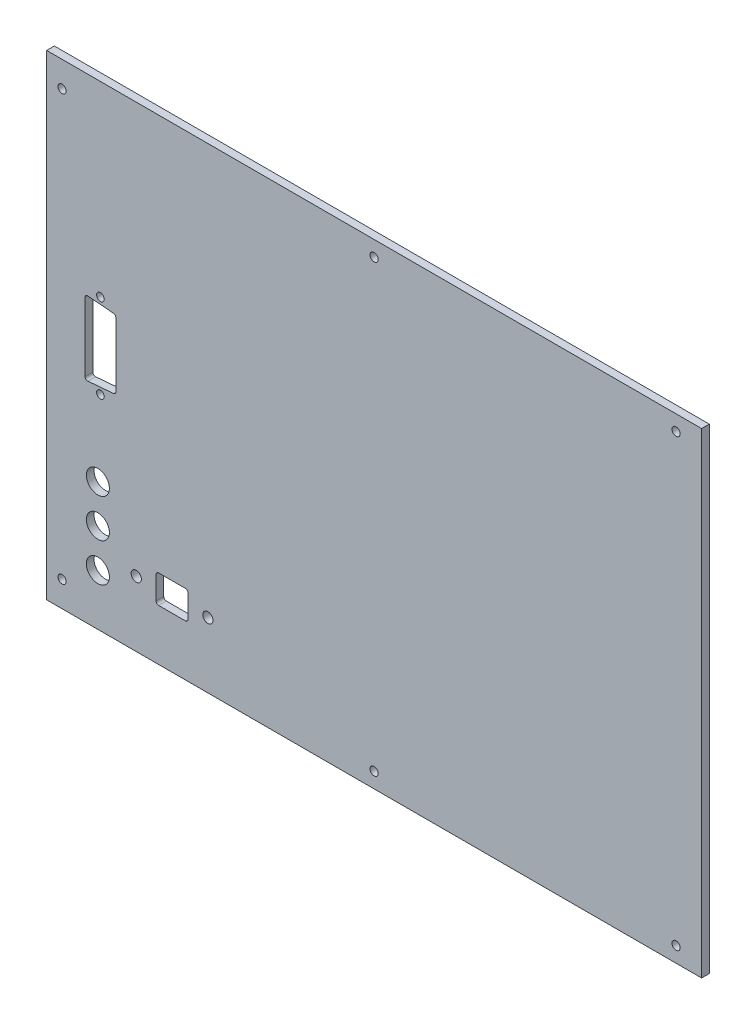
ISO-10303-21;
HEADER;
FILE_DESCRIPTION(('STEP AP214'),'2;1');
FILE_NAME('part.step','',(''),(''),'','','');
FILE_SCHEMA(('AUTOMOTIVE_DESIGN { 1 0 10303 214 1 1 1 1 }'));
ENDSEC;
DATA;
#1=APPLICATION_CONTEXT('core data for automotive mechanical design processes');
#2=APPLICATION_PROTOCOL_DEFINITION('international standard','automotive_design',2000,#1);
#3=PRODUCT_CONTEXT('',#1,'mechanical');
#4=PRODUCT('Part','Part','',(#3));
#5=PRODUCT_RELATED_PRODUCT_CATEGORY('part','',(#4));
#6=PRODUCT_DEFINITION_FORMATION('','',#4);
#7=PRODUCT_DEFINITION_CONTEXT('part definition',#1,'design');
#8=PRODUCT_DEFINITION('design','',#6,#7);
#9=PRODUCT_DEFINITION_SHAPE('','',#8);
#10=(LENGTH_UNIT() NAMED_UNIT(*) SI_UNIT(.MILLI.,.METRE.));
#11=(NAMED_UNIT(*) PLANE_ANGLE_UNIT() SI_UNIT($,.RADIAN.));
#12=(NAMED_UNIT(*) SI_UNIT($,.STERADIAN.) SOLID_ANGLE_UNIT());
#13=UNCERTAINTY_MEASURE_WITH_UNIT(LENGTH_MEASURE(1.E-05),#10,'distance_accuracy_value','');
#14=(GEOMETRIC_REPRESENTATION_CONTEXT(3) GLOBAL_UNCERTAINTY_ASSIGNED_CONTEXT((#13)) GLOBAL_UNIT_ASSIGNED_CONTEXT((#10,
#11,#12)) REPRESENTATION_CONTEXT('',''));
#15=CARTESIAN_POINT('',(0.,0.,0.));
#16=DIRECTION('',(0.,0.,1.));
#17=DIRECTION('',(1.,0.,0.));
#18=AXIS2_PLACEMENT_3D('',#15,#16,#17);
#19=CARTESIAN_POINT('',(0.,0.,3.));
#20=DIRECTION('',(1.,0.,0.));
#21=DIRECTION('',(0.,0.,-1.));
#22=AXIS2_PLACEMENT_3D('',#19,#20,#21);
#23=PLANE('',#22);
#24=DIRECTION('',(0.,-1.,0.));
#25=VECTOR('',#24,1.);
#26=CARTESIAN_POINT('',(0.,0.,0.));
#27=LINE('',#26,#25);
#28=CARTESIAN_POINT('',(0.,186.,0.));
#29=VERTEX_POINT('',#28);
#30=CARTESIAN_POINT('',(0.,0.,0.));
#31=VERTEX_POINT('',#30);
#32=EDGE_CURVE('E194',#29,#31,#27,.T.);
#33=ORIENTED_EDGE('',*,*,#32,.T.);
#34=DIRECTION('',(0.,0.,-1.));
#35=VECTOR('',#34,1.);
#36=CARTESIAN_POINT('',(0.,0.,3.));
#37=LINE('',#36,#35);
#38=CARTESIAN_POINT('',(0.,0.,3.));
#39=VERTEX_POINT('',#38);
#40=EDGE_CURVE('E175',#39,#31,#37,.T.);
#41=ORIENTED_EDGE('',*,*,#40,.F.);
#42=DIRECTION('',(0.,-1.,0.));
#43=VECTOR('',#42,1.);
#44=CARTESIAN_POINT('',(0.,0.,3.));
#45=LINE('',#44,#43);
#46=CARTESIAN_POINT('',(0.,186.,3.));
#47=VERTEX_POINT('',#46);
#48=EDGE_CURVE('E182',#47,#39,#45,.T.);
#49=ORIENTED_EDGE('',*,*,#48,.F.);
#50=DIRECTION('',(0.,0.,-1.));
#51=VECTOR('',#50,1.);
#52=CARTESIAN_POINT('',(0.,186.,3.));
#53=LINE('',#52,#51);
#54=EDGE_CURVE('E396',#47,#29,#53,.T.);
#55=ORIENTED_EDGE('',*,*,#54,.T.);
#56=EDGE_LOOP('',(#33,#41,#49,#55));
#57=FACE_BOUND('',#56,.T.);
#58=ADVANCED_FACE('F34',(#57),#23,.F.);
#59=CARTESIAN_POINT('',(0.,0.,3.));
#60=DIRECTION('',(0.,1.,0.));
#61=DIRECTION('',(0.,0.,1.));
#62=AXIS2_PLACEMENT_3D('',#59,#60,#61);
#63=PLANE('',#62);
#64=DIRECTION('',(1.,0.,0.));
#65=VECTOR('',#64,1.);
#66=CARTESIAN_POINT('',(0.,0.,0.));
#67=LINE('',#66,#65);
#68=CARTESIAN_POINT('',(256.,0.,0.));
#69=VERTEX_POINT('',#68);
#70=EDGE_CURVE('E398',#31,#69,#67,.T.);
#71=ORIENTED_EDGE('',*,*,#70,.T.);
#72=DIRECTION('',(0.,0.,-1.));
#73=VECTOR('',#72,1.);
#74=CARTESIAN_POINT('',(256.,0.,3.));
#75=LINE('',#74,#73);
#76=CARTESIAN_POINT('',(256.,0.,3.));
#77=VERTEX_POINT('',#76);
#78=EDGE_CURVE('E178',#77,#69,#75,.T.);
#79=ORIENTED_EDGE('',*,*,#78,.F.);
#80=DIRECTION('',(1.,0.,0.));
#81=VECTOR('',#80,1.);
#82=CARTESIAN_POINT('',(0.,0.,3.));
#83=LINE('',#82,#81);
#84=EDGE_CURVE('E171',#39,#77,#83,.T.);
#85=ORIENTED_EDGE('',*,*,#84,.F.);
#86=ORIENTED_EDGE('',*,*,#40,.T.);
#87=EDGE_LOOP('',(#71,#79,#85,#86));
#88=FACE_BOUND('',#87,.T.);
#89=ADVANCED_FACE('F173',(#88),#63,.F.);
#90=CARTESIAN_POINT('',(256.,0.,3.));
#91=DIRECTION('',(-1.,0.,0.));
#92=DIRECTION('',(0.,0.,1.));
#93=AXIS2_PLACEMENT_3D('',#90,#91,#92);
#94=PLANE('',#93);
#95=DIRECTION('',(0.,1.,0.));
#96=VECTOR('',#95,1.);
#97=CARTESIAN_POINT('',(256.,0.,0.));
#98=LINE('',#97,#96);
#99=CARTESIAN_POINT('',(256.,186.,0.));
#100=VERTEX_POINT('',#99);
#101=EDGE_CURVE('E400',#69,#100,#98,.T.);
#102=ORIENTED_EDGE('',*,*,#101,.T.);
#103=DIRECTION('',(0.,0.,-1.));
#104=VECTOR('',#103,1.);
#105=CARTESIAN_POINT('',(256.,186.,3.));
#106=LINE('',#105,#104);
#107=CARTESIAN_POINT('',(256.,186.,3.));
#108=VERTEX_POINT('',#107);
#109=EDGE_CURVE('E200',#108,#100,#106,.T.);
#110=ORIENTED_EDGE('',*,*,#109,.F.);
#111=DIRECTION('',(0.,1.,0.));
#112=VECTOR('',#111,1.);
#113=CARTESIAN_POINT('',(256.,0.,3.));
#114=LINE('',#113,#112);
#115=EDGE_CURVE('E181',#77,#108,#114,.T.);
#116=ORIENTED_EDGE('',*,*,#115,.F.);
#117=ORIENTED_EDGE('',*,*,#78,.T.);
#118=EDGE_LOOP('',(#102,#110,#116,#117));
#119=FACE_BOUND('',#118,.T.);
#120=ADVANCED_FACE('F412',(#119),#94,.F.);
#121=CARTESIAN_POINT('',(0.,186.,3.));
#122=DIRECTION('',(0.,-1.,0.));
#123=DIRECTION('',(0.,0.,-1.));
#124=AXIS2_PLACEMENT_3D('',#121,#122,#123);
#125=PLANE('',#124);
#126=DIRECTION('',(-1.,0.,0.));
#127=VECTOR('',#126,1.);
#128=CARTESIAN_POINT('',(0.,186.,0.));
#129=LINE('',#128,#127);
#130=EDGE_CURVE('E191',#100,#29,#129,.T.);
#131=ORIENTED_EDGE('',*,*,#130,.T.);
#132=ORIENTED_EDGE('',*,*,#54,.F.);
#133=DIRECTION('',(-1.,0.,0.));
#134=VECTOR('',#133,1.);
#135=CARTESIAN_POINT('',(0.,186.,3.));
#136=LINE('',#135,#134);
#137=EDGE_CURVE('E187',#108,#47,#136,.T.);
#138=ORIENTED_EDGE('',*,*,#137,.F.);
#139=ORIENTED_EDGE('',*,*,#109,.T.);
#140=EDGE_LOOP('',(#131,#132,#138,#139));
#141=FACE_BOUND('',#140,.T.);
#142=ADVANCED_FACE('F407',(#141),#125,.F.);
#143=CARTESIAN_POINT('',(0.,0.,3.));
#144=DIRECTION('',(0.,0.,-1.));
#145=DIRECTION('',(-1.,0.,0.));
#146=AXIS2_PLACEMENT_3D('',#143,#144,#145);
#147=PLANE('',#146);
#148=CARTESIAN_POINT('',(21.,113.,3.));
#149=DIRECTION('',(0.,0.,1.));
#150=DIRECTION('',(1.,0.,0.));
#151=AXIS2_PLACEMENT_3D('',#148,#149,#150);
#152=CIRCLE('',#151,1.5);
#153=CARTESIAN_POINT('',(22.5,113.,3.));
#154=VERTEX_POINT('',#153);
#155=EDGE_CURVE('E559',#154,#154,#152,.T.);
#156=ORIENTED_EDGE('',*,*,#155,.F.);
#157=EDGE_LOOP('',(#156));
#158=FACE_BOUND('',#157,.T.);
#159=CARTESIAN_POINT('',(21.,80.,3.));
#160=DIRECTION('',(0.,0.,1.));
#161=DIRECTION('',(1.,0.,0.));
#162=AXIS2_PLACEMENT_3D('',#159,#160,#161);
#163=CIRCLE('',#162,1.5);
#164=CARTESIAN_POINT('',(22.5,80.,3.));
#165=VERTEX_POINT('',#164);
#166=EDGE_CURVE('E326',#165,#165,#163,.T.);
#167=ORIENTED_EDGE('',*,*,#166,.F.);
#168=EDGE_LOOP('',(#167));
#169=FACE_BOUND('',#168,.T.);
#170=DIRECTION('',(0.,-1.,0.));
#171=VECTOR('',#170,1.);
#172=CARTESIAN_POINT('',(15.,111.,3.));
#173=LINE('',#172,#171);
#174=CARTESIAN_POINT('',(15.,109.913200451767,3.));
#175=VERTEX_POINT('',#174);
#176=CARTESIAN_POINT('',(15.,83.0867995482327,3.));
#177=VERTEX_POINT('',#176);
#178=EDGE_CURVE('E303',#175,#177,#173,.T.);
#179=ORIENTED_EDGE('',*,*,#178,.F.);
#180=CARTESIAN_POINT('',(16.,109.913200451767,3.));
#181=DIRECTION('',(0.,0.,-1.));
#182=DIRECTION('',(-1.,0.,0.));
#183=AXIS2_PLACEMENT_3D('',#180,#181,#182);
#184=CIRCLE('',#183,1.);
#185=CARTESIAN_POINT('',(16.0830454798537,110.909746210012,3.));
#186=VERTEX_POINT('',#185);
#187=EDGE_CURVE('E42',#175,#186,#184,.T.);
#188=ORIENTED_EDGE('',*,*,#187,.T.);
#189=DIRECTION('',(-0.99654575824488,0.08304547985374,0.));
#190=VECTOR('',#189,1.);
#191=CARTESIAN_POINT('',(27.,110.,3.));
#192=LINE('',#191,#190);
#193=CARTESIAN_POINT('',(26.0830454798537,110.076412876679,3.));
#194=VERTEX_POINT('',#193);
#195=EDGE_CURVE('E302',#194,#186,#192,.T.);
#196=ORIENTED_EDGE('',*,*,#195,.F.);
#197=CARTESIAN_POINT('',(26.,109.079867118434,3.));
#198=DIRECTION('',(0.,0.,-1.));
#199=DIRECTION('',(-1.,0.,0.));
#200=AXIS2_PLACEMENT_3D('',#197,#198,#199);
#201=CIRCLE('',#200,1.);
#202=CARTESIAN_POINT('',(27.,109.079867118434,3.));
#203=VERTEX_POINT('',#202);
#204=EDGE_CURVE('E286',#194,#203,#201,.T.);
#205=ORIENTED_EDGE('',*,*,#204,.T.);
#206=DIRECTION('',(0.,1.,0.));
#207=VECTOR('',#206,1.);
#208=CARTESIAN_POINT('',(27.,83.,3.));
#209=LINE('',#208,#207);
#210=CARTESIAN_POINT('',(27.,83.920132881566,3.));
#211=VERTEX_POINT('',#210);
#212=EDGE_CURVE('E321',#211,#203,#209,.T.);
#213=ORIENTED_EDGE('',*,*,#212,.F.);
#214=CARTESIAN_POINT('',(26.,83.920132881566,3.));
#215=DIRECTION('',(0.,0.,-1.));
#216=DIRECTION('',(-1.,0.,0.));
#217=AXIS2_PLACEMENT_3D('',#214,#215,#216);
#218=CIRCLE('',#217,1.);
#219=CARTESIAN_POINT('',(26.0830454798537,82.9235871233212,3.));
#220=VERTEX_POINT('',#219);
#221=EDGE_CURVE('E290',#211,#220,#218,.T.);
#222=ORIENTED_EDGE('',*,*,#221,.T.);
#223=DIRECTION('',(0.99654575824488,0.08304547985374,0.));
#224=VECTOR('',#223,1.);
#225=CARTESIAN_POINT('',(15.,82.,3.));
#226=LINE('',#225,#224);
#227=CARTESIAN_POINT('',(16.0830454798537,82.0902537899878,3.));
#228=VERTEX_POINT('',#227);
#229=EDGE_CURVE('E329',#228,#220,#226,.T.);
#230=ORIENTED_EDGE('',*,*,#229,.F.);
#231=CARTESIAN_POINT('',(16.,83.0867995482327,3.));
#232=DIRECTION('',(0.,0.,-1.));
#233=DIRECTION('',(-1.,0.,0.));
#234=AXIS2_PLACEMENT_3D('',#231,#232,#233);
#235=CIRCLE('',#234,1.);
#236=EDGE_CURVE('E294',#228,#177,#235,.T.);
#237=ORIENTED_EDGE('',*,*,#236,.T.);
#238=EDGE_LOOP('',(#179,#188,#196,#205,#213,#222,#230,#237));
#239=FACE_BOUND('',#238,.T.);
#240=CARTESIAN_POINT('',(20.,20.,3.));
#241=DIRECTION('',(0.,0.,1.));
#242=DIRECTION('',(1.,0.,0.));
#243=AXIS2_PLACEMENT_3D('',#240,#241,#242);
#244=CIRCLE('',#243,4.49999999999999);
#245=CARTESIAN_POINT('',(24.5,20.,3.));
#246=VERTEX_POINT('',#245);
#247=EDGE_CURVE('E261',#246,#246,#244,.T.);
#248=ORIENTED_EDGE('',*,*,#247,.F.);
#249=EDGE_LOOP('',(#248));
#250=FACE_BOUND('',#249,.T.);
#251=CARTESIAN_POINT('',(20.,35.,3.));
#252=DIRECTION('',(0.,0.,1.));
#253=DIRECTION('',(1.,0.,0.));
#254=AXIS2_PLACEMENT_3D('',#251,#252,#253);
#255=CIRCLE('',#254,4.49999999999999);
#256=CARTESIAN_POINT('',(24.5,35.,3.));
#257=VERTEX_POINT('',#256);
#258=EDGE_CURVE('E336',#257,#257,#255,.T.);
#259=ORIENTED_EDGE('',*,*,#258,.F.);
#260=EDGE_LOOP('',(#259));
#261=FACE_BOUND('',#260,.T.);
#262=CARTESIAN_POINT('',(20.,50.,3.));
#263=DIRECTION('',(0.,0.,1.));
#264=DIRECTION('',(1.,0.,0.));
#265=AXIS2_PLACEMENT_3D('',#262,#263,#264);
#266=CIRCLE('',#265,4.50000000000001);
#267=CARTESIAN_POINT('',(24.5,50.,3.));
#268=VERTEX_POINT('',#267);
#269=EDGE_CURVE('E339',#268,#268,#266,.T.);
#270=ORIENTED_EDGE('',*,*,#269,.F.);
#271=EDGE_LOOP('',(#270));
#272=FACE_BOUND('',#271,.T.);
#273=CARTESIAN_POINT('',(63.,25.5,3.));
#274=DIRECTION('',(0.,0.,1.));
#275=DIRECTION('',(1.,0.,0.));
#276=AXIS2_PLACEMENT_3D('',#273,#274,#275);
#277=CIRCLE('',#276,2.);
#278=CARTESIAN_POINT('',(65.,25.5,3.));
#279=VERTEX_POINT('',#278);
#280=EDGE_CURVE('E267',#279,#279,#277,.T.);
#281=ORIENTED_EDGE('',*,*,#280,.F.);
#282=EDGE_LOOP('',(#281));
#283=FACE_BOUND('',#282,.T.);
#284=CARTESIAN_POINT('',(35.,25.5,3.));
#285=DIRECTION('',(0.,0.,1.));
#286=DIRECTION('',(1.,0.,0.));
#287=AXIS2_PLACEMENT_3D('',#284,#285,#286);
#288=CIRCLE('',#287,2.);
#289=CARTESIAN_POINT('',(37.,25.5,3.));
#290=VERTEX_POINT('',#289);
#291=EDGE_CURVE('E343',#290,#290,#288,.T.);
#292=ORIENTED_EDGE('',*,*,#291,.F.);
#293=EDGE_LOOP('',(#292));
#294=FACE_BOUND('',#293,.T.);
#295=DIRECTION('',(1.,0.,0.));
#296=VECTOR('',#295,1.);
#297=CARTESIAN_POINT('',(42.75,20.,3.));
#298=LINE('',#297,#296);
#299=CARTESIAN_POINT('',(43.75,20.,3.));
#300=VERTEX_POINT('',#299);
#301=CARTESIAN_POINT('',(54.25,20.,3.));
#302=VERTEX_POINT('',#301);
#303=EDGE_CURVE('E351',#300,#302,#298,.T.);
#304=ORIENTED_EDGE('',*,*,#303,.F.);
#305=CARTESIAN_POINT('',(43.75,21.,3.));
#306=DIRECTION('',(0.,0.,-1.));
#307=DIRECTION('',(-1.,0.,0.));
#308=AXIS2_PLACEMENT_3D('',#305,#306,#307);
#309=CIRCLE('',#308,1.);
#310=CARTESIAN_POINT('',(42.75,21.,3.));
#311=VERTEX_POINT('',#310);
#312=EDGE_CURVE('E252',#300,#311,#309,.T.);
#313=ORIENTED_EDGE('',*,*,#312,.T.);
#314=DIRECTION('',(0.,-1.,0.));
#315=VECTOR('',#314,1.);
#316=CARTESIAN_POINT('',(42.75,31.,3.));
#317=LINE('',#316,#315);
#318=CARTESIAN_POINT('',(42.75,30.,3.));
#319=VERTEX_POINT('',#318);
#320=EDGE_CURVE('E346',#319,#311,#317,.T.);
#321=ORIENTED_EDGE('',*,*,#320,.F.);
#322=CARTESIAN_POINT('',(43.75,30.,3.));
#323=DIRECTION('',(0.,0.,-1.));
#324=DIRECTION('',(-1.,0.,0.));
#325=AXIS2_PLACEMENT_3D('',#322,#323,#324);
#326=CIRCLE('',#325,1.);
#327=CARTESIAN_POINT('',(43.75,31.,3.));
#328=VERTEX_POINT('',#327);
#329=EDGE_CURVE('E248',#319,#328,#326,.T.);
#330=ORIENTED_EDGE('',*,*,#329,.T.);
#331=DIRECTION('',(-1.,0.,0.));
#332=VECTOR('',#331,1.);
#333=CARTESIAN_POINT('',(42.75,31.,3.));
#334=LINE('',#333,#332);
#335=CARTESIAN_POINT('',(54.25,31.,3.));
#336=VERTEX_POINT('',#335);
#337=EDGE_CURVE('E217',#336,#328,#334,.T.);
#338=ORIENTED_EDGE('',*,*,#337,.F.);
#339=CARTESIAN_POINT('',(54.25,30.,3.));
#340=DIRECTION('',(0.,0.,-1.));
#341=DIRECTION('',(-1.,0.,0.));
#342=AXIS2_PLACEMENT_3D('',#339,#340,#341);
#343=CIRCLE('',#342,1.);
#344=CARTESIAN_POINT('',(55.25,30.,3.));
#345=VERTEX_POINT('',#344);
#346=EDGE_CURVE('E240',#336,#345,#343,.T.);
#347=ORIENTED_EDGE('',*,*,#346,.T.);
#348=DIRECTION('',(0.,1.,0.));
#349=VECTOR('',#348,1.);
#350=CARTESIAN_POINT('',(55.25,31.,3.));
#351=LINE('',#350,#349);
#352=CARTESIAN_POINT('',(55.25,21.,3.));
#353=VERTEX_POINT('',#352);
#354=EDGE_CURVE('E354',#353,#345,#351,.T.);
#355=ORIENTED_EDGE('',*,*,#354,.F.);
#356=CARTESIAN_POINT('',(54.25,21.,3.));
#357=DIRECTION('',(0.,0.,-1.));
#358=DIRECTION('',(-1.,0.,0.));
#359=AXIS2_PLACEMENT_3D('',#356,#357,#358);
#360=CIRCLE('',#359,1.);
#361=EDGE_CURVE('E244',#353,#302,#360,.T.);
#362=ORIENTED_EDGE('',*,*,#361,.T.);
#363=EDGE_LOOP('',(#304,#313,#321,#330,#338,#347,#355,#362));
#364=FACE_BOUND('',#363,.T.);
#365=CARTESIAN_POINT('',(6.00000000000001,10.,3.));
#366=DIRECTION('',(0.,0.,1.));
#367=DIRECTION('',(1.,0.,0.));
#368=AXIS2_PLACEMENT_3D('',#365,#366,#367);
#369=CIRCLE('',#368,1.6);
#370=CARTESIAN_POINT('',(7.60000000000001,10.,3.));
#371=VERTEX_POINT('',#370);
#372=EDGE_CURVE('E220',#371,#371,#369,.T.);
#373=ORIENTED_EDGE('',*,*,#372,.F.);
#374=EDGE_LOOP('',(#373));
#375=FACE_BOUND('',#374,.T.);
#376=CARTESIAN_POINT('',(128.,6.,3.));
#377=DIRECTION('',(0.,0.,1.));
#378=DIRECTION('',(1.,0.,0.));
#379=AXIS2_PLACEMENT_3D('',#376,#377,#378);
#380=CIRCLE('',#379,1.59999999999999);
#381=CARTESIAN_POINT('',(129.6,6.,3.));
#382=VERTEX_POINT('',#381);
#383=EDGE_CURVE('E381',#382,#382,#380,.T.);
#384=ORIENTED_EDGE('',*,*,#383,.F.);
#385=EDGE_LOOP('',(#384));
#386=FACE_BOUND('',#385,.T.);
#387=CARTESIAN_POINT('',(246.,6.,3.));
#388=DIRECTION('',(0.,0.,1.));
#389=DIRECTION('',(1.,0.,0.));
#390=AXIS2_PLACEMENT_3D('',#387,#388,#389);
#391=CIRCLE('',#390,1.59999999999999);
#392=CARTESIAN_POINT('',(247.6,6.,3.));
#393=VERTEX_POINT('',#392);
#394=EDGE_CURVE('E375',#393,#393,#391,.T.);
#395=ORIENTED_EDGE('',*,*,#394,.F.);
#396=EDGE_LOOP('',(#395));
#397=FACE_BOUND('',#396,.T.);
#398=CARTESIAN_POINT('',(246.,180.,3.));
#399=DIRECTION('',(0.,0.,1.));
#400=DIRECTION('',(1.,0.,0.));
#401=AXIS2_PLACEMENT_3D('',#398,#399,#400);
#402=CIRCLE('',#401,1.59999999999999);
#403=CARTESIAN_POINT('',(247.6,180.,3.));
#404=VERTEX_POINT('',#403);
#405=EDGE_CURVE('E369',#404,#404,#402,.T.);
#406=ORIENTED_EDGE('',*,*,#405,.F.);
#407=EDGE_LOOP('',(#406));
#408=FACE_BOUND('',#407,.T.);
#409=CARTESIAN_POINT('',(128.,180.,3.));
#410=DIRECTION('',(0.,0.,1.));
#411=DIRECTION('',(1.,0.,0.));
#412=AXIS2_PLACEMENT_3D('',#409,#410,#411);
#413=CIRCLE('',#412,1.59999999999999);
#414=CARTESIAN_POINT('',(129.6,180.,3.));
#415=VERTEX_POINT('',#414);
#416=EDGE_CURVE('E363',#415,#415,#413,.T.);
#417=ORIENTED_EDGE('',*,*,#416,.F.);
#418=EDGE_LOOP('',(#417));
#419=FACE_BOUND('',#418,.T.);
#420=CARTESIAN_POINT('',(6.00000000000001,176.,3.));
#421=DIRECTION('',(0.,0.,1.));
#422=DIRECTION('',(1.,0.,0.));
#423=AXIS2_PLACEMENT_3D('',#420,#421,#422);
#424=CIRCLE('',#423,1.59999999999999);
#425=CARTESIAN_POINT('',(7.6,176.,3.));
#426=VERTEX_POINT('',#425);
#427=EDGE_CURVE('E362',#426,#426,#424,.T.);
#428=ORIENTED_EDGE('',*,*,#427,.F.);
#429=EDGE_LOOP('',(#428));
#430=FACE_BOUND('',#429,.T.);
#431=ORIENTED_EDGE('',*,*,#48,.T.);
#432=ORIENTED_EDGE('',*,*,#84,.T.);
#433=ORIENTED_EDGE('',*,*,#115,.T.);
#434=ORIENTED_EDGE('',*,*,#137,.T.);
#435=EDGE_LOOP('',(#431,#432,#433,#434));
#436=FACE_BOUND('',#435,.T.);
#437=ADVANCED_FACE('F185',(#158,#169,#239,#250,#261,#272,#283,#294,#364,#375,#386,#397,#408,
#419,#430,#436),#147,.F.);
#438=CARTESIAN_POINT('',(0.,0.,0.));
#439=DIRECTION('',(0.,0.,-1.));
#440=DIRECTION('',(-1.,0.,0.));
#441=AXIS2_PLACEMENT_3D('',#438,#439,#440);
#442=PLANE('',#441);
#443=CARTESIAN_POINT('',(21.,113.,0.));
#444=DIRECTION('',(0.,0.,1.));
#445=DIRECTION('',(1.,0.,0.));
#446=AXIS2_PLACEMENT_3D('',#443,#444,#445);
#447=CIRCLE('',#446,1.5);
#448=CARTESIAN_POINT('',(22.5,113.,0.));
#449=VERTEX_POINT('',#448);
#450=EDGE_CURVE('E342',#449,#449,#447,.T.);
#451=ORIENTED_EDGE('',*,*,#450,.T.);
#452=EDGE_LOOP('',(#451));
#453=FACE_BOUND('',#452,.T.);
#454=CARTESIAN_POINT('',(21.,80.,0.));
#455=DIRECTION('',(0.,0.,1.));
#456=DIRECTION('',(1.,0.,0.));
#457=AXIS2_PLACEMENT_3D('',#454,#455,#456);
#458=CIRCLE('',#457,1.5);
#459=CARTESIAN_POINT('',(22.5,80.,0.));
#460=VERTEX_POINT('',#459);
#461=EDGE_CURVE('E557',#460,#460,#458,.T.);
#462=ORIENTED_EDGE('',*,*,#461,.T.);
#463=EDGE_LOOP('',(#462));
#464=FACE_BOUND('',#463,.T.);
#465=DIRECTION('',(0.,1.,0.));
#466=VECTOR('',#465,1.);
#467=CARTESIAN_POINT('',(27.,83.,0.));
#468=LINE('',#467,#466);
#469=CARTESIAN_POINT('',(27.,83.920132881566,0.));
#470=VERTEX_POINT('',#469);
#471=CARTESIAN_POINT('',(27.,109.079867118434,0.));
#472=VERTEX_POINT('',#471);
#473=EDGE_CURVE('E319',#470,#472,#468,.T.);
#474=ORIENTED_EDGE('',*,*,#473,.T.);
#475=CARTESIAN_POINT('',(26.,109.079867118434,0.));
#476=DIRECTION('',(0.,0.,-1.));
#477=DIRECTION('',(-1.,0.,0.));
#478=AXIS2_PLACEMENT_3D('',#475,#476,#477);
#479=CIRCLE('',#478,1.);
#480=CARTESIAN_POINT('',(26.0830454798537,110.076412876679,0.));
#481=VERTEX_POINT('',#480);
#482=EDGE_CURVE('E288',#472,#481,#479,.F.);
#483=ORIENTED_EDGE('',*,*,#482,.T.);
#484=DIRECTION('',(-0.99654575824488,0.08304547985374,0.));
#485=VECTOR('',#484,1.);
#486=CARTESIAN_POINT('',(27.,110.,0.));
#487=LINE('',#486,#485);
#488=CARTESIAN_POINT('',(16.0830454798537,110.909746210012,0.));
#489=VERTEX_POINT('',#488);
#490=EDGE_CURVE('E316',#481,#489,#487,.T.);
#491=ORIENTED_EDGE('',*,*,#490,.T.);
#492=CARTESIAN_POINT('',(16.,109.913200451767,0.));
#493=DIRECTION('',(0.,0.,-1.));
#494=DIRECTION('',(-1.,0.,0.));
#495=AXIS2_PLACEMENT_3D('',#492,#493,#494);
#496=CIRCLE('',#495,1.);
#497=CARTESIAN_POINT('',(15.,109.913200451767,0.));
#498=VERTEX_POINT('',#497);
#499=EDGE_CURVE('E11',#489,#498,#496,.F.);
#500=ORIENTED_EDGE('',*,*,#499,.T.);
#501=DIRECTION('',(0.,-1.,0.));
#502=VECTOR('',#501,1.);
#503=CARTESIAN_POINT('',(15.,111.,0.));
#504=LINE('',#503,#502);
#505=CARTESIAN_POINT('',(15.,83.0867995482327,0.));
#506=VERTEX_POINT('',#505);
#507=EDGE_CURVE('E313',#498,#506,#504,.T.);
#508=ORIENTED_EDGE('',*,*,#507,.T.);
#509=CARTESIAN_POINT('',(16.,83.0867995482327,0.));
#510=DIRECTION('',(0.,0.,-1.));
#511=DIRECTION('',(-1.,0.,0.));
#512=AXIS2_PLACEMENT_3D('',#509,#510,#511);
#513=CIRCLE('',#512,1.);
#514=CARTESIAN_POINT('',(16.0830454798537,82.0902537899878,0.));
#515=VERTEX_POINT('',#514);
#516=EDGE_CURVE('E296',#506,#515,#513,.F.);
#517=ORIENTED_EDGE('',*,*,#516,.T.);
#518=DIRECTION('',(0.99654575824488,0.08304547985374,0.));
#519=VECTOR('',#518,1.);
#520=CARTESIAN_POINT('',(15.,82.,0.));
#521=LINE('',#520,#519);
#522=CARTESIAN_POINT('',(26.0830454798537,82.9235871233212,0.));
#523=VERTEX_POINT('',#522);
#524=EDGE_CURVE('E315',#515,#523,#521,.T.);
#525=ORIENTED_EDGE('',*,*,#524,.T.);
#526=CARTESIAN_POINT('',(26.,83.920132881566,0.));
#527=DIRECTION('',(0.,0.,-1.));
#528=DIRECTION('',(-1.,0.,0.));
#529=AXIS2_PLACEMENT_3D('',#526,#527,#528);
#530=CIRCLE('',#529,1.);
#531=EDGE_CURVE('E292',#523,#470,#530,.F.);
#532=ORIENTED_EDGE('',*,*,#531,.T.);
#533=EDGE_LOOP('',(#474,#483,#491,#500,#508,#517,#525,#532));
#534=FACE_BOUND('',#533,.T.);
#535=CARTESIAN_POINT('',(20.,20.,0.));
#536=DIRECTION('',(0.,0.,-1.));
#537=DIRECTION('',(-1.,0.,0.));
#538=AXIS2_PLACEMENT_3D('',#535,#536,#537);
#539=CIRCLE('',#538,4.49999999999999);
#540=CARTESIAN_POINT('',(15.5,20.,0.));
#541=VERTEX_POINT('',#540);
#542=EDGE_CURVE('E264',#541,#541,#539,.T.);
#543=ORIENTED_EDGE('',*,*,#542,.F.);
#544=EDGE_LOOP('',(#543));
#545=FACE_BOUND('',#544,.T.);
#546=CARTESIAN_POINT('',(20.,35.,0.));
#547=DIRECTION('',(0.,0.,-1.));
#548=DIRECTION('',(-1.,0.,0.));
#549=AXIS2_PLACEMENT_3D('',#546,#547,#548);
#550=CIRCLE('',#549,4.49999999999999);
#551=CARTESIAN_POINT('',(15.5,35.,0.));
#552=VERTEX_POINT('',#551);
#553=EDGE_CURVE('E260',#552,#552,#550,.T.);
#554=ORIENTED_EDGE('',*,*,#553,.F.);
#555=EDGE_LOOP('',(#554));
#556=FACE_BOUND('',#555,.T.);
#557=CARTESIAN_POINT('',(20.,50.,0.));
#558=DIRECTION('',(0.,0.,-1.));
#559=DIRECTION('',(-1.,0.,0.));
#560=AXIS2_PLACEMENT_3D('',#557,#558,#559);
#561=CIRCLE('',#560,4.50000000000001);
#562=CARTESIAN_POINT('',(15.5,50.,0.));
#563=VERTEX_POINT('',#562);
#564=EDGE_CURVE('E257',#563,#563,#561,.T.);
#565=ORIENTED_EDGE('',*,*,#564,.F.);
#566=EDGE_LOOP('',(#565));
#567=FACE_BOUND('',#566,.T.);
#568=CARTESIAN_POINT('',(63.,25.5,0.));
#569=DIRECTION('',(0.,0.,-1.));
#570=DIRECTION('',(-1.,0.,0.));
#571=AXIS2_PLACEMENT_3D('',#568,#569,#570);
#572=CIRCLE('',#571,2.);
#573=CARTESIAN_POINT('',(61.,25.5,0.));
#574=VERTEX_POINT('',#573);
#575=EDGE_CURVE('E216',#574,#574,#572,.T.);
#576=ORIENTED_EDGE('',*,*,#575,.F.);
#577=EDGE_LOOP('',(#576));
#578=FACE_BOUND('',#577,.T.);
#579=CARTESIAN_POINT('',(35.,25.5,0.));
#580=DIRECTION('',(0.,0.,-1.));
#581=DIRECTION('',(-1.,0.,0.));
#582=AXIS2_PLACEMENT_3D('',#579,#580,#581);
#583=CIRCLE('',#582,2.);
#584=CARTESIAN_POINT('',(33.,25.5,0.));
#585=VERTEX_POINT('',#584);
#586=EDGE_CURVE('E213',#585,#585,#583,.T.);
#587=ORIENTED_EDGE('',*,*,#586,.F.);
#588=EDGE_LOOP('',(#587));
#589=FACE_BOUND('',#588,.T.);
#590=DIRECTION('',(0.,1.,0.));
#591=VECTOR('',#590,1.);
#592=CARTESIAN_POINT('',(42.75,0.,0.));
#593=LINE('',#592,#591);
#594=CARTESIAN_POINT('',(42.75,21.,0.));
#595=VERTEX_POINT('',#594);
#596=CARTESIAN_POINT('',(42.75,30.,0.));
#597=VERTEX_POINT('',#596);
#598=EDGE_CURVE('E209',#595,#597,#593,.T.);
#599=ORIENTED_EDGE('',*,*,#598,.F.);
#600=CARTESIAN_POINT('',(43.75,21.,0.));
#601=DIRECTION('',(0.,0.,-1.));
#602=DIRECTION('',(-1.,0.,0.));
#603=AXIS2_PLACEMENT_3D('',#600,#601,#602);
#604=CIRCLE('',#603,1.);
#605=CARTESIAN_POINT('',(43.75,20.,0.));
#606=VERTEX_POINT('',#605);
#607=EDGE_CURVE('E254',#595,#606,#604,.F.);
#608=ORIENTED_EDGE('',*,*,#607,.T.);
#609=DIRECTION('',(-1.,0.,0.));
#610=VECTOR('',#609,1.);
#611=CARTESIAN_POINT('',(0.,20.,0.));
#612=LINE('',#611,#610);
#613=CARTESIAN_POINT('',(54.25,20.,0.));
#614=VERTEX_POINT('',#613);
#615=EDGE_CURVE('E195',#614,#606,#612,.T.);
#616=ORIENTED_EDGE('',*,*,#615,.F.);
#617=CARTESIAN_POINT('',(54.25,21.,0.));
#618=DIRECTION('',(0.,0.,-1.));
#619=DIRECTION('',(-1.,0.,0.));
#620=AXIS2_PLACEMENT_3D('',#617,#618,#619);
#621=CIRCLE('',#620,1.);
#622=CARTESIAN_POINT('',(55.25,21.,0.));
#623=VERTEX_POINT('',#622);
#624=EDGE_CURVE('E246',#614,#623,#621,.F.);
#625=ORIENTED_EDGE('',*,*,#624,.T.);
#626=DIRECTION('',(0.,-1.,0.));
#627=VECTOR('',#626,1.);
#628=CARTESIAN_POINT('',(55.25,0.,0.));
#629=LINE('',#628,#627);
#630=CARTESIAN_POINT('',(55.25,30.,0.));
#631=VERTEX_POINT('',#630);
#632=EDGE_CURVE('E198',#631,#623,#629,.T.);
#633=ORIENTED_EDGE('',*,*,#632,.F.);
#634=CARTESIAN_POINT('',(54.25,30.,0.));
#635=DIRECTION('',(0.,0.,-1.));
#636=DIRECTION('',(-1.,0.,0.));
#637=AXIS2_PLACEMENT_3D('',#634,#635,#636);
#638=CIRCLE('',#637,1.);
#639=CARTESIAN_POINT('',(54.25,31.,0.));
#640=VERTEX_POINT('',#639);
#641=EDGE_CURVE('E242',#631,#640,#638,.F.);
#642=ORIENTED_EDGE('',*,*,#641,.T.);
#643=DIRECTION('',(1.,0.,0.));
#644=VECTOR('',#643,1.);
#645=CARTESIAN_POINT('',(0.,31.,0.));
#646=LINE('',#645,#644);
#647=CARTESIAN_POINT('',(43.75,31.,0.));
#648=VERTEX_POINT('',#647);
#649=EDGE_CURVE('E206',#648,#640,#646,.T.);
#650=ORIENTED_EDGE('',*,*,#649,.F.);
#651=CARTESIAN_POINT('',(43.75,30.,0.));
#652=DIRECTION('',(0.,0.,-1.));
#653=DIRECTION('',(-1.,0.,0.));
#654=AXIS2_PLACEMENT_3D('',#651,#652,#653);
#655=CIRCLE('',#654,1.);
#656=EDGE_CURVE('E250',#648,#597,#655,.F.);
#657=ORIENTED_EDGE('',*,*,#656,.T.);
#658=EDGE_LOOP('',(#599,#608,#616,#625,#633,#642,#650,#657));
#659=FACE_BOUND('',#658,.T.);
#660=CARTESIAN_POINT('',(6.00000000000001,10.,0.));
#661=DIRECTION('',(0.,0.,1.));
#662=DIRECTION('',(1.,0.,0.));
#663=AXIS2_PLACEMENT_3D('',#660,#661,#662);
#664=CIRCLE('',#663,1.6);
#665=CARTESIAN_POINT('',(7.60000000000001,10.,0.));
#666=VERTEX_POINT('',#665);
#667=EDGE_CURVE('E384',#666,#666,#664,.T.);
#668=ORIENTED_EDGE('',*,*,#667,.T.);
#669=EDGE_LOOP('',(#668));
#670=FACE_BOUND('',#669,.T.);
#671=CARTESIAN_POINT('',(128.,6.,0.));
#672=DIRECTION('',(0.,0.,1.));
#673=DIRECTION('',(1.,0.,0.));
#674=AXIS2_PLACEMENT_3D('',#671,#672,#673);
#675=CIRCLE('',#674,1.59999999999999);
#676=CARTESIAN_POINT('',(129.6,6.,0.));
#677=VERTEX_POINT('',#676);
#678=EDGE_CURVE('E378',#677,#677,#675,.T.);
#679=ORIENTED_EDGE('',*,*,#678,.T.);
#680=EDGE_LOOP('',(#679));
#681=FACE_BOUND('',#680,.T.);
#682=CARTESIAN_POINT('',(246.,6.,0.));
#683=DIRECTION('',(0.,0.,1.));
#684=DIRECTION('',(1.,0.,0.));
#685=AXIS2_PLACEMENT_3D('',#682,#683,#684);
#686=CIRCLE('',#685,1.59999999999999);
#687=CARTESIAN_POINT('',(247.6,6.,0.));
#688=VERTEX_POINT('',#687);
#689=EDGE_CURVE('E372',#688,#688,#686,.T.);
#690=ORIENTED_EDGE('',*,*,#689,.T.);
#691=EDGE_LOOP('',(#690));
#692=FACE_BOUND('',#691,.T.);
#693=CARTESIAN_POINT('',(246.,180.,0.));
#694=DIRECTION('',(0.,0.,1.));
#695=DIRECTION('',(1.,0.,0.));
#696=AXIS2_PLACEMENT_3D('',#693,#694,#695);
#697=CIRCLE('',#696,1.59999999999999);
#698=CARTESIAN_POINT('',(247.6,180.,0.));
#699=VERTEX_POINT('',#698);
#700=EDGE_CURVE('E366',#699,#699,#697,.T.);
#701=ORIENTED_EDGE('',*,*,#700,.T.);
#702=EDGE_LOOP('',(#701));
#703=FACE_BOUND('',#702,.T.);
#704=CARTESIAN_POINT('',(128.,180.,0.));
#705=DIRECTION('',(0.,0.,1.));
#706=DIRECTION('',(1.,0.,0.));
#707=AXIS2_PLACEMENT_3D('',#704,#705,#706);
#708=CIRCLE('',#707,1.59999999999999);
#709=CARTESIAN_POINT('',(129.6,180.,0.));
#710=VERTEX_POINT('',#709);
#711=EDGE_CURVE('E359',#710,#710,#708,.T.);
#712=ORIENTED_EDGE('',*,*,#711,.T.);
#713=EDGE_LOOP('',(#712));
#714=FACE_BOUND('',#713,.T.);
#715=CARTESIAN_POINT('',(6.00000000000001,176.,0.));
#716=DIRECTION('',(0.,0.,1.));
#717=DIRECTION('',(1.,0.,0.));
#718=AXIS2_PLACEMENT_3D('',#715,#716,#717);
#719=CIRCLE('',#718,1.59999999999999);
#720=CARTESIAN_POINT('',(7.6,176.,0.));
#721=VERTEX_POINT('',#720);
#722=EDGE_CURVE('E389',#721,#721,#719,.T.);
#723=ORIENTED_EDGE('',*,*,#722,.T.);
#724=EDGE_LOOP('',(#723));
#725=FACE_BOUND('',#724,.T.);
#726=ORIENTED_EDGE('',*,*,#32,.F.);
#727=ORIENTED_EDGE('',*,*,#130,.F.);
#728=ORIENTED_EDGE('',*,*,#101,.F.);
#729=ORIENTED_EDGE('',*,*,#70,.F.);
#730=EDGE_LOOP('',(#726,#727,#728,#729));
#731=FACE_BOUND('',#730,.T.);
#732=ADVANCED_FACE('F411',(#453,#464,#534,#545,#556,#567,#578,#589,#659,#670,#681,#692,#703,
#714,#725,#731),#442,.T.);
#733=CARTESIAN_POINT('',(6.00000000000001,176.,0.));
#734=DIRECTION('',(0.,0.,1.));
#735=DIRECTION('',(1.,0.,0.));
#736=AXIS2_PLACEMENT_3D('',#733,#734,#735);
#737=CYLINDRICAL_SURFACE('',#736,1.59999999999999);
#738=ORIENTED_EDGE('',*,*,#722,.F.);
#739=EDGE_LOOP('',(#738));
#740=FACE_BOUND('',#739,.T.);
#741=ORIENTED_EDGE('',*,*,#427,.T.);
#742=EDGE_LOOP('',(#741));
#743=FACE_BOUND('',#742,.T.);
#744=ADVANCED_FACE('F526',(#740,#743),#737,.F.);
#745=CARTESIAN_POINT('',(128.,180.,0.));
#746=DIRECTION('',(0.,0.,1.));
#747=DIRECTION('',(1.,0.,0.));
#748=AXIS2_PLACEMENT_3D('',#745,#746,#747);
#749=CYLINDRICAL_SURFACE('',#748,1.59999999999999);
#750=ORIENTED_EDGE('',*,*,#711,.F.);
#751=EDGE_LOOP('',(#750));
#752=FACE_BOUND('',#751,.T.);
#753=ORIENTED_EDGE('',*,*,#416,.T.);
#754=EDGE_LOOP('',(#753));
#755=FACE_BOUND('',#754,.T.);
#756=ADVANCED_FACE('F522',(#752,#755),#749,.F.);
#757=CARTESIAN_POINT('',(246.,180.,0.));
#758=DIRECTION('',(0.,0.,1.));
#759=DIRECTION('',(1.,0.,0.));
#760=AXIS2_PLACEMENT_3D('',#757,#758,#759);
#761=CYLINDRICAL_SURFACE('',#760,1.59999999999999);
#762=ORIENTED_EDGE('',*,*,#700,.F.);
#763=EDGE_LOOP('',(#762));
#764=FACE_BOUND('',#763,.T.);
#765=ORIENTED_EDGE('',*,*,#405,.T.);
#766=EDGE_LOOP('',(#765));
#767=FACE_BOUND('',#766,.T.);
#768=ADVANCED_FACE('F525',(#764,#767),#761,.F.);
#769=CARTESIAN_POINT('',(246.,6.,0.));
#770=DIRECTION('',(0.,0.,1.));
#771=DIRECTION('',(1.,0.,0.));
#772=AXIS2_PLACEMENT_3D('',#769,#770,#771);
#773=CYLINDRICAL_SURFACE('',#772,1.59999999999999);
#774=ORIENTED_EDGE('',*,*,#689,.F.);
#775=EDGE_LOOP('',(#774));
#776=FACE_BOUND('',#775,.T.);
#777=ORIENTED_EDGE('',*,*,#394,.T.);
#778=EDGE_LOOP('',(#777));
#779=FACE_BOUND('',#778,.T.);
#780=ADVANCED_FACE('F530',(#776,#779),#773,.F.);
#781=CARTESIAN_POINT('',(128.,6.,0.));
#782=DIRECTION('',(0.,0.,1.));
#783=DIRECTION('',(1.,0.,0.));
#784=AXIS2_PLACEMENT_3D('',#781,#782,#783);
#785=CYLINDRICAL_SURFACE('',#784,1.59999999999999);
#786=ORIENTED_EDGE('',*,*,#678,.F.);
#787=EDGE_LOOP('',(#786));
#788=FACE_BOUND('',#787,.T.);
#789=ORIENTED_EDGE('',*,*,#383,.T.);
#790=EDGE_LOOP('',(#789));
#791=FACE_BOUND('',#790,.T.);
#792=ADVANCED_FACE('F534',(#788,#791),#785,.F.);
#793=CARTESIAN_POINT('',(6.00000000000001,10.,0.));
#794=DIRECTION('',(0.,0.,1.));
#795=DIRECTION('',(1.,0.,0.));
#796=AXIS2_PLACEMENT_3D('',#793,#794,#795);
#797=CYLINDRICAL_SURFACE('',#796,1.6);
#798=ORIENTED_EDGE('',*,*,#667,.F.);
#799=EDGE_LOOP('',(#798));
#800=FACE_BOUND('',#799,.T.);
#801=ORIENTED_EDGE('',*,*,#372,.T.);
#802=EDGE_LOOP('',(#801));
#803=FACE_BOUND('',#802,.T.);
#804=ADVANCED_FACE('F520',(#800,#803),#797,.F.);
#805=CARTESIAN_POINT('',(42.75,31.,-7.));
#806=DIRECTION('',(-1.,0.,0.));
#807=DIRECTION('',(0.,-1.,0.));
#808=AXIS2_PLACEMENT_3D('',#805,#806,#807);
#809=PLANE('',#808);
#810=ORIENTED_EDGE('',*,*,#598,.T.);
#811=DIRECTION('',(0.,0.,1.));
#812=VECTOR('',#811,1.);
#813=CARTESIAN_POINT('',(42.75,30.,3.));
#814=LINE('',#813,#812);
#815=EDGE_CURVE('E237',#597,#319,#814,.T.);
#816=ORIENTED_EDGE('',*,*,#815,.T.);
#817=ORIENTED_EDGE('',*,*,#320,.T.);
#818=DIRECTION('',(0.,0.,1.));
#819=VECTOR('',#818,1.);
#820=CARTESIAN_POINT('',(42.75,21.,0.));
#821=LINE('',#820,#819);
#822=EDGE_CURVE('E235',#311,#595,#821,.F.);
#823=ORIENTED_EDGE('',*,*,#822,.T.);
#824=EDGE_LOOP('',(#810,#816,#817,#823));
#825=FACE_BOUND('',#824,.T.);
#826=ADVANCED_FACE('F510',(#825),#809,.F.);
#827=CARTESIAN_POINT('',(42.75,31.,-7.));
#828=DIRECTION('',(0.,1.,0.));
#829=DIRECTION('',(0.,0.,1.));
#830=AXIS2_PLACEMENT_3D('',#827,#828,#829);
#831=PLANE('',#830);
#832=ORIENTED_EDGE('',*,*,#649,.T.);
#833=DIRECTION('',(0.,0.,1.));
#834=VECTOR('',#833,1.);
#835=CARTESIAN_POINT('',(54.25,31.,3.));
#836=LINE('',#835,#834);
#837=EDGE_CURVE('E222',#640,#336,#836,.T.);
#838=ORIENTED_EDGE('',*,*,#837,.T.);
#839=ORIENTED_EDGE('',*,*,#337,.T.);
#840=DIRECTION('',(0.,0.,1.));
#841=VECTOR('',#840,1.);
#842=CARTESIAN_POINT('',(43.75,31.,0.));
#843=LINE('',#842,#841);
#844=EDGE_CURVE('E212',#328,#648,#843,.F.);
#845=ORIENTED_EDGE('',*,*,#844,.T.);
#846=EDGE_LOOP('',(#832,#838,#839,#845));
#847=FACE_BOUND('',#846,.T.);
#848=ADVANCED_FACE('F506',(#847),#831,.F.);
#849=CARTESIAN_POINT('',(55.25,31.,-7.));
#850=DIRECTION('',(1.,0.,0.));
#851=DIRECTION('',(0.,1.,0.));
#852=AXIS2_PLACEMENT_3D('',#849,#850,#851);
#853=PLANE('',#852);
#854=ORIENTED_EDGE('',*,*,#354,.T.);
#855=DIRECTION('',(0.,0.,1.));
#856=VECTOR('',#855,1.);
#857=CARTESIAN_POINT('',(55.25,30.,0.));
#858=LINE('',#857,#856);
#859=EDGE_CURVE('E228',#345,#631,#858,.F.);
#860=ORIENTED_EDGE('',*,*,#859,.T.);
#861=ORIENTED_EDGE('',*,*,#632,.T.);
#862=DIRECTION('',(0.,0.,1.));
#863=VECTOR('',#862,1.);
#864=CARTESIAN_POINT('',(55.25,21.,3.));
#865=LINE('',#864,#863);
#866=EDGE_CURVE('E225',#623,#353,#865,.T.);
#867=ORIENTED_EDGE('',*,*,#866,.T.);
#868=EDGE_LOOP('',(#854,#860,#861,#867));
#869=FACE_BOUND('',#868,.T.);
#870=ADVANCED_FACE('F509',(#869),#853,.F.);
#871=CARTESIAN_POINT('',(42.75,20.,-7.));
#872=DIRECTION('',(0.,-1.,0.));
#873=DIRECTION('',(0.,0.,-1.));
#874=AXIS2_PLACEMENT_3D('',#871,#872,#873);
#875=PLANE('',#874);
#876=ORIENTED_EDGE('',*,*,#303,.T.);
#877=DIRECTION('',(0.,0.,1.));
#878=VECTOR('',#877,1.);
#879=CARTESIAN_POINT('',(54.25,20.,0.));
#880=LINE('',#879,#878);
#881=EDGE_CURVE('E233',#302,#614,#880,.F.);
#882=ORIENTED_EDGE('',*,*,#881,.T.);
#883=ORIENTED_EDGE('',*,*,#615,.T.);
#884=DIRECTION('',(0.,0.,1.));
#885=VECTOR('',#884,1.);
#886=CARTESIAN_POINT('',(43.75,20.,3.));
#887=LINE('',#886,#885);
#888=EDGE_CURVE('E230',#606,#300,#887,.T.);
#889=ORIENTED_EDGE('',*,*,#888,.T.);
#890=EDGE_LOOP('',(#876,#882,#883,#889));
#891=FACE_BOUND('',#890,.T.);
#892=ADVANCED_FACE('F501',(#891),#875,.F.);
#893=CARTESIAN_POINT('',(35.,25.5,-7.));
#894=DIRECTION('',(0.,0.,1.));
#895=DIRECTION('',(1.,0.,0.));
#896=AXIS2_PLACEMENT_3D('',#893,#894,#895);
#897=CYLINDRICAL_SURFACE('',#896,2.);
#898=ORIENTED_EDGE('',*,*,#586,.T.);
#899=EDGE_LOOP('',(#898));
#900=FACE_BOUND('',#899,.T.);
#901=ORIENTED_EDGE('',*,*,#291,.T.);
#902=EDGE_LOOP('',(#901));
#903=FACE_BOUND('',#902,.T.);
#904=ADVANCED_FACE('F498',(#900,#903),#897,.F.);
#905=CARTESIAN_POINT('',(63.,25.5,-7.));
#906=DIRECTION('',(0.,0.,1.));
#907=DIRECTION('',(1.,0.,0.));
#908=AXIS2_PLACEMENT_3D('',#905,#906,#907);
#909=CYLINDRICAL_SURFACE('',#908,2.);
#910=ORIENTED_EDGE('',*,*,#575,.T.);
#911=EDGE_LOOP('',(#910));
#912=FACE_BOUND('',#911,.T.);
#913=ORIENTED_EDGE('',*,*,#280,.T.);
#914=EDGE_LOOP('',(#913));
#915=FACE_BOUND('',#914,.T.);
#916=ADVANCED_FACE('F430',(#912,#915),#909,.F.);
#917=CARTESIAN_POINT('',(54.25,30.,-7.));
#918=DIRECTION('',(0.,0.,-1.));
#919=DIRECTION('',(-1.,0.,0.));
#920=AXIS2_PLACEMENT_3D('',#917,#918,#919);
#921=CYLINDRICAL_SURFACE('',#920,1.);
#922=ORIENTED_EDGE('',*,*,#641,.F.);
#923=ORIENTED_EDGE('',*,*,#859,.F.);
#924=ORIENTED_EDGE('',*,*,#346,.F.);
#925=ORIENTED_EDGE('',*,*,#837,.F.);
#926=EDGE_LOOP('',(#922,#923,#924,#925));
#927=FACE_BOUND('',#926,.T.);
#928=ADVANCED_FACE('F426',(#927),#921,.F.);
#929=CARTESIAN_POINT('',(54.25,21.,-7.));
#930=DIRECTION('',(0.,0.,-1.));
#931=DIRECTION('',(-1.,0.,0.));
#932=AXIS2_PLACEMENT_3D('',#929,#930,#931);
#933=CYLINDRICAL_SURFACE('',#932,1.);
#934=ORIENTED_EDGE('',*,*,#624,.F.);
#935=ORIENTED_EDGE('',*,*,#881,.F.);
#936=ORIENTED_EDGE('',*,*,#361,.F.);
#937=ORIENTED_EDGE('',*,*,#866,.F.);
#938=EDGE_LOOP('',(#934,#935,#936,#937));
#939=FACE_BOUND('',#938,.T.);
#940=ADVANCED_FACE('F429',(#939),#933,.F.);
#941=CARTESIAN_POINT('',(43.75,30.,-7.));
#942=DIRECTION('',(0.,0.,-1.));
#943=DIRECTION('',(-1.,0.,0.));
#944=AXIS2_PLACEMENT_3D('',#941,#942,#943);
#945=CYLINDRICAL_SURFACE('',#944,1.);
#946=ORIENTED_EDGE('',*,*,#656,.F.);
#947=ORIENTED_EDGE('',*,*,#844,.F.);
#948=ORIENTED_EDGE('',*,*,#329,.F.);
#949=ORIENTED_EDGE('',*,*,#815,.F.);
#950=EDGE_LOOP('',(#946,#947,#948,#949));
#951=FACE_BOUND('',#950,.T.);
#952=ADVANCED_FACE('F434',(#951),#945,.F.);
#953=CARTESIAN_POINT('',(43.75,21.,-7.));
#954=DIRECTION('',(0.,0.,-1.));
#955=DIRECTION('',(-1.,0.,0.));
#956=AXIS2_PLACEMENT_3D('',#953,#954,#955);
#957=CYLINDRICAL_SURFACE('',#956,1.);
#958=ORIENTED_EDGE('',*,*,#607,.F.);
#959=ORIENTED_EDGE('',*,*,#822,.F.);
#960=ORIENTED_EDGE('',*,*,#312,.F.);
#961=ORIENTED_EDGE('',*,*,#888,.F.);
#962=EDGE_LOOP('',(#958,#959,#960,#961));
#963=FACE_BOUND('',#962,.T.);
#964=ADVANCED_FACE('F438',(#963),#957,.F.);
#965=CARTESIAN_POINT('',(20.,50.,-7.));
#966=DIRECTION('',(0.,0.,1.));
#967=DIRECTION('',(1.,0.,0.));
#968=AXIS2_PLACEMENT_3D('',#965,#966,#967);
#969=CYLINDRICAL_SURFACE('',#968,4.50000000000001);
#970=ORIENTED_EDGE('',*,*,#564,.T.);
#971=EDGE_LOOP('',(#970));
#972=FACE_BOUND('',#971,.T.);
#973=ORIENTED_EDGE('',*,*,#269,.T.);
#974=EDGE_LOOP('',(#973));
#975=FACE_BOUND('',#974,.T.);
#976=ADVANCED_FACE('F442',(#972,#975),#969,.F.);
#977=CARTESIAN_POINT('',(20.,35.,-7.));
#978=DIRECTION('',(0.,0.,1.));
#979=DIRECTION('',(1.,0.,0.));
#980=AXIS2_PLACEMENT_3D('',#977,#978,#979);
#981=CYLINDRICAL_SURFACE('',#980,4.49999999999999);
#982=ORIENTED_EDGE('',*,*,#553,.T.);
#983=EDGE_LOOP('',(#982));
#984=FACE_BOUND('',#983,.T.);
#985=ORIENTED_EDGE('',*,*,#258,.T.);
#986=EDGE_LOOP('',(#985));
#987=FACE_BOUND('',#986,.T.);
#988=ADVANCED_FACE('F490',(#984,#987),#981,.F.);
#989=CARTESIAN_POINT('',(20.,20.,-7.));
#990=DIRECTION('',(0.,0.,1.));
#991=DIRECTION('',(1.,0.,0.));
#992=AXIS2_PLACEMENT_3D('',#989,#990,#991);
#993=CYLINDRICAL_SURFACE('',#992,4.49999999999999);
#994=ORIENTED_EDGE('',*,*,#542,.T.);
#995=EDGE_LOOP('',(#994));
#996=FACE_BOUND('',#995,.T.);
#997=ORIENTED_EDGE('',*,*,#247,.T.);
#998=EDGE_LOOP('',(#997));
#999=FACE_BOUND('',#998,.T.);
#1000=ADVANCED_FACE('F480',(#996,#999),#993,.F.);
#1001=CARTESIAN_POINT('',(27.,110.,0.));
#1002=DIRECTION('',(0.08304547985374,0.99654575824488,0.));
#1003=DIRECTION('',(-0.99654575824488,0.08304547985374,0.));
#1004=AXIS2_PLACEMENT_3D('',#1001,#1002,#1003);
#1005=PLANE('',#1004);
#1006=ORIENTED_EDGE('',*,*,#490,.F.);
#1007=DIRECTION('',(0.,0.,1.));
#1008=VECTOR('',#1007,1.);
#1009=CARTESIAN_POINT('',(26.0830454798537,110.076412876679,3.));
#1010=LINE('',#1009,#1008);
#1011=EDGE_CURVE('E269',#481,#194,#1010,.T.);
#1012=ORIENTED_EDGE('',*,*,#1011,.T.);
#1013=ORIENTED_EDGE('',*,*,#195,.T.);
#1014=DIRECTION('',(0.,0.,1.));
#1015=VECTOR('',#1014,1.);
#1016=CARTESIAN_POINT('',(16.0830454798537,110.909746210012,0.));
#1017=LINE('',#1016,#1015);
#1018=EDGE_CURVE('E256',#186,#489,#1017,.F.);
#1019=ORIENTED_EDGE('',*,*,#1018,.T.);
#1020=EDGE_LOOP('',(#1006,#1012,#1013,#1019));
#1021=FACE_BOUND('',#1020,.T.);
#1022=ADVANCED_FACE('F309',(#1021),#1005,.F.);
#1023=CARTESIAN_POINT('',(27.,83.,0.));
#1024=DIRECTION('',(1.,0.,0.));
#1025=DIRECTION('',(0.,0.,-1.));
#1026=AXIS2_PLACEMENT_3D('',#1023,#1024,#1025);
#1027=PLANE('',#1026);
#1028=ORIENTED_EDGE('',*,*,#212,.T.);
#1029=DIRECTION('',(0.,0.,1.));
#1030=VECTOR('',#1029,1.);
#1031=CARTESIAN_POINT('',(27.,109.079867118434,0.));
#1032=LINE('',#1031,#1030);
#1033=EDGE_CURVE('E275',#203,#472,#1032,.F.);
#1034=ORIENTED_EDGE('',*,*,#1033,.T.);
#1035=ORIENTED_EDGE('',*,*,#473,.F.);
#1036=DIRECTION('',(0.,0.,1.));
#1037=VECTOR('',#1036,1.);
#1038=CARTESIAN_POINT('',(27.,83.920132881566,3.));
#1039=LINE('',#1038,#1037);
#1040=EDGE_CURVE('E272',#470,#211,#1039,.T.);
#1041=ORIENTED_EDGE('',*,*,#1040,.T.);
#1042=EDGE_LOOP('',(#1028,#1034,#1035,#1041));
#1043=FACE_BOUND('',#1042,.T.);
#1044=ADVANCED_FACE('F470',(#1043),#1027,.F.);
#1045=CARTESIAN_POINT('',(15.,82.,0.));
#1046=DIRECTION('',(0.08304547985374,-0.99654575824488,0.));
#1047=DIRECTION('',(0.99654575824488,0.08304547985374,0.));
#1048=AXIS2_PLACEMENT_3D('',#1045,#1046,#1047);
#1049=PLANE('',#1048);
#1050=ORIENTED_EDGE('',*,*,#229,.T.);
#1051=DIRECTION('',(0.,0.,1.));
#1052=VECTOR('',#1051,1.);
#1053=CARTESIAN_POINT('',(26.0830454798537,82.9235871233212,0.));
#1054=LINE('',#1053,#1052);
#1055=EDGE_CURVE('E280',#220,#523,#1054,.F.);
#1056=ORIENTED_EDGE('',*,*,#1055,.T.);
#1057=ORIENTED_EDGE('',*,*,#524,.F.);
#1058=DIRECTION('',(0.,0.,1.));
#1059=VECTOR('',#1058,1.);
#1060=CARTESIAN_POINT('',(16.0830454798537,82.0902537899878,3.));
#1061=LINE('',#1060,#1059);
#1062=EDGE_CURVE('E277',#515,#228,#1061,.T.);
#1063=ORIENTED_EDGE('',*,*,#1062,.T.);
#1064=EDGE_LOOP('',(#1050,#1056,#1057,#1063));
#1065=FACE_BOUND('',#1064,.T.);
#1066=ADVANCED_FACE('F463',(#1065),#1049,.F.);
#1067=CARTESIAN_POINT('',(15.,111.,0.));
#1068=DIRECTION('',(-1.,0.,0.));
#1069=DIRECTION('',(0.,0.,1.));
#1070=AXIS2_PLACEMENT_3D('',#1067,#1068,#1069);
#1071=PLANE('',#1070);
#1072=ORIENTED_EDGE('',*,*,#178,.T.);
#1073=DIRECTION('',(0.,0.,1.));
#1074=VECTOR('',#1073,1.);
#1075=CARTESIAN_POINT('',(15.,83.0867995482327,0.));
#1076=LINE('',#1075,#1074);
#1077=EDGE_CURVE('E49',#177,#506,#1076,.F.);
#1078=ORIENTED_EDGE('',*,*,#1077,.T.);
#1079=ORIENTED_EDGE('',*,*,#507,.F.);
#1080=DIRECTION('',(0.,0.,1.));
#1081=VECTOR('',#1080,1.);
#1082=CARTESIAN_POINT('',(15.,109.913200451767,3.));
#1083=LINE('',#1082,#1081);
#1084=EDGE_CURVE('E282',#498,#175,#1083,.T.);
#1085=ORIENTED_EDGE('',*,*,#1084,.T.);
#1086=EDGE_LOOP('',(#1072,#1078,#1079,#1085));
#1087=FACE_BOUND('',#1086,.T.);
#1088=ADVANCED_FACE('F312',(#1087),#1071,.F.);
#1089=CARTESIAN_POINT('',(21.,80.,0.));
#1090=DIRECTION('',(0.,0.,1.));
#1091=DIRECTION('',(1.,0.,0.));
#1092=AXIS2_PLACEMENT_3D('',#1089,#1090,#1091);
#1093=CYLINDRICAL_SURFACE('',#1092,1.5);
#1094=ORIENTED_EDGE('',*,*,#461,.F.);
#1095=EDGE_LOOP('',(#1094));
#1096=FACE_BOUND('',#1095,.T.);
#1097=ORIENTED_EDGE('',*,*,#166,.T.);
#1098=EDGE_LOOP('',(#1097));
#1099=FACE_BOUND('',#1098,.T.);
#1100=ADVANCED_FACE('F483',(#1096,#1099),#1093,.F.);
#1101=CARTESIAN_POINT('',(21.,113.,0.));
#1102=DIRECTION('',(0.,0.,1.));
#1103=DIRECTION('',(1.,0.,0.));
#1104=AXIS2_PLACEMENT_3D('',#1101,#1102,#1103);
#1105=CYLINDRICAL_SURFACE('',#1104,1.5);
#1106=ORIENTED_EDGE('',*,*,#450,.F.);
#1107=EDGE_LOOP('',(#1106));
#1108=FACE_BOUND('',#1107,.T.);
#1109=ORIENTED_EDGE('',*,*,#155,.T.);
#1110=EDGE_LOOP('',(#1109));
#1111=FACE_BOUND('',#1110,.T.);
#1112=ADVANCED_FACE('F448',(#1108,#1111),#1105,.F.);
#1113=CARTESIAN_POINT('',(26.,109.079867118434,0.));
#1114=DIRECTION('',(0.,0.,-1.));
#1115=DIRECTION('',(-1.,0.,0.));
#1116=AXIS2_PLACEMENT_3D('',#1113,#1114,#1115);
#1117=CYLINDRICAL_SURFACE('',#1116,1.);
#1118=ORIENTED_EDGE('',*,*,#482,.F.);
#1119=ORIENTED_EDGE('',*,*,#1033,.F.);
#1120=ORIENTED_EDGE('',*,*,#204,.F.);
#1121=ORIENTED_EDGE('',*,*,#1011,.F.);
#1122=EDGE_LOOP('',(#1118,#1119,#1120,#1121));
#1123=FACE_BOUND('',#1122,.T.);
#1124=ADVANCED_FACE('F444',(#1123),#1117,.F.);
#1125=CARTESIAN_POINT('',(26.,83.920132881566,0.));
#1126=DIRECTION('',(0.,0.,-1.));
#1127=DIRECTION('',(-1.,0.,0.));
#1128=AXIS2_PLACEMENT_3D('',#1125,#1126,#1127);
#1129=CYLINDRICAL_SURFACE('',#1128,1.);
#1130=ORIENTED_EDGE('',*,*,#531,.F.);
#1131=ORIENTED_EDGE('',*,*,#1055,.F.);
#1132=ORIENTED_EDGE('',*,*,#221,.F.);
#1133=ORIENTED_EDGE('',*,*,#1040,.F.);
#1134=EDGE_LOOP('',(#1130,#1131,#1132,#1133));
#1135=FACE_BOUND('',#1134,.T.);
#1136=ADVANCED_FACE('F447',(#1135),#1129,.F.);
#1137=CARTESIAN_POINT('',(16.,83.0867995482327,0.));
#1138=DIRECTION('',(0.,0.,-1.));
#1139=DIRECTION('',(-1.,0.,0.));
#1140=AXIS2_PLACEMENT_3D('',#1137,#1138,#1139);
#1141=CYLINDRICAL_SURFACE('',#1140,1.);
#1142=ORIENTED_EDGE('',*,*,#516,.F.);
#1143=ORIENTED_EDGE('',*,*,#1077,.F.);
#1144=ORIENTED_EDGE('',*,*,#236,.F.);
#1145=ORIENTED_EDGE('',*,*,#1062,.F.);
#1146=EDGE_LOOP('',(#1142,#1143,#1144,#1145));
#1147=FACE_BOUND('',#1146,.T.);
#1148=ADVANCED_FACE('F451',(#1147),#1141,.F.);
#1149=CARTESIAN_POINT('',(16.,109.913200451767,0.));
#1150=DIRECTION('',(0.,0.,-1.));
#1151=DIRECTION('',(-1.,0.,0.));
#1152=AXIS2_PLACEMENT_3D('',#1149,#1150,#1151);
#1153=CYLINDRICAL_SURFACE('',#1152,1.);
#1154=ORIENTED_EDGE('',*,*,#499,.F.);
#1155=ORIENTED_EDGE('',*,*,#1018,.F.);
#1156=ORIENTED_EDGE('',*,*,#187,.F.);
#1157=ORIENTED_EDGE('',*,*,#1084,.F.);
#1158=EDGE_LOOP('',(#1154,#1155,#1156,#1157));
#1159=FACE_BOUND('',#1158,.T.);
#1160=ADVANCED_FACE('F36',(#1159),#1153,.F.);
#1161=CLOSED_SHELL('',(#58,#89,#120,#142,#437,#732,#744,#756,#768,#780,#792,#804,#826,#848,#870,
#892,#904,#916,#928,#940,#952,#964,#976,#988,#1000,#1022,#1044,#1066,#1088,#1100,#1112,#1124,
#1136,#1148,#1160));
#1162=MANIFOLD_SOLID_BREP('B2',#1161);
#1163=ADVANCED_BREP_SHAPE_REPRESENTATION('',(#18,#1162),#14);
#1164=SHAPE_DEFINITION_REPRESENTATION(#9,#1163);
ENDSEC;
END-ISO-10303-21;
